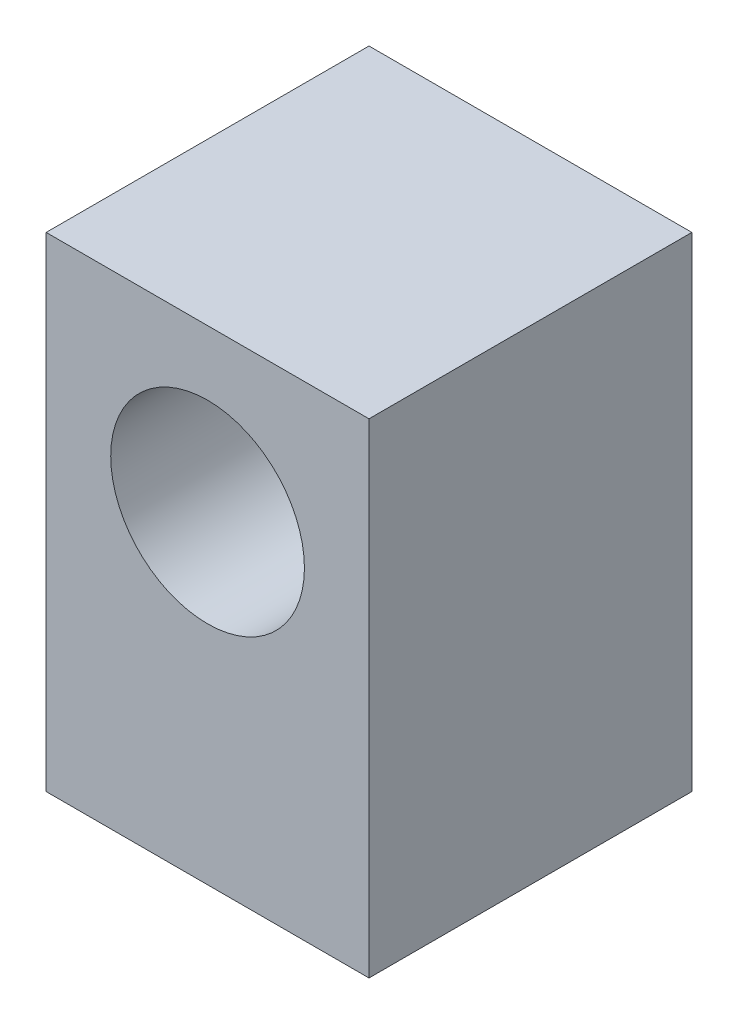
ISO-10303-21;
HEADER;
FILE_DESCRIPTION(('STEP AP214'),'2;1');
FILE_NAME('part.step','',(''),(''),'','','');
FILE_SCHEMA(('AUTOMOTIVE_DESIGN { 1 0 10303 214 1 1 1 1 }'));
ENDSEC;
DATA;
#1=APPLICATION_CONTEXT('core data for automotive mechanical design processes');
#2=APPLICATION_PROTOCOL_DEFINITION('international standard','automotive_design',2000,#1);
#3=PRODUCT_CONTEXT('',#1,'mechanical');
#4=PRODUCT('Part','Part','',(#3));
#5=PRODUCT_RELATED_PRODUCT_CATEGORY('part','',(#4));
#6=PRODUCT_DEFINITION_FORMATION('','',#4);
#7=PRODUCT_DEFINITION_CONTEXT('part definition',#1,'design');
#8=PRODUCT_DEFINITION('design','',#6,#7);
#9=PRODUCT_DEFINITION_SHAPE('','',#8);
#10=(LENGTH_UNIT() NAMED_UNIT(*) SI_UNIT(.MILLI.,.METRE.));
#11=(NAMED_UNIT(*) PLANE_ANGLE_UNIT() SI_UNIT($,.RADIAN.));
#12=(NAMED_UNIT(*) SI_UNIT($,.STERADIAN.) SOLID_ANGLE_UNIT());
#13=UNCERTAINTY_MEASURE_WITH_UNIT(LENGTH_MEASURE(1.E-05),#10,'distance_accuracy_value','');
#14=(GEOMETRIC_REPRESENTATION_CONTEXT(3) GLOBAL_UNCERTAINTY_ASSIGNED_CONTEXT((#13)) GLOBAL_UNIT_ASSIGNED_CONTEXT((#10,
#11,#12)) REPRESENTATION_CONTEXT('',''));
#15=CARTESIAN_POINT('',(0.,0.,0.));
#16=DIRECTION('',(0.,0.,1.));
#17=DIRECTION('',(1.,0.,0.));
#18=AXIS2_PLACEMENT_3D('',#15,#16,#17);
#19=CARTESIAN_POINT('',(10.,30.,-10.));
#20=DIRECTION('',(-1.,0.,0.));
#21=DIRECTION('',(0.,0.,1.));
#22=AXIS2_PLACEMENT_3D('',#19,#20,#21);
#23=PLANE('',#22);
#24=DIRECTION('',(0.,0.,-1.));
#25=VECTOR('',#24,1.);
#26=CARTESIAN_POINT('',(10.,0.,-10.));
#27=LINE('',#26,#25);
#28=CARTESIAN_POINT('',(10.,0.,10.));
#29=VERTEX_POINT('',#28);
#30=CARTESIAN_POINT('',(10.,0.,-10.));
#31=VERTEX_POINT('',#30);
#32=EDGE_CURVE('E108',#29,#31,#27,.T.);
#33=ORIENTED_EDGE('',*,*,#32,.T.);
#34=DIRECTION('',(0.,-1.,0.));
#35=VECTOR('',#34,1.);
#36=CARTESIAN_POINT('',(10.,30.,-10.));
#37=LINE('',#36,#35);
#38=CARTESIAN_POINT('',(10.,30.,-10.));
#39=VERTEX_POINT('',#38);
#40=EDGE_CURVE('E13',#39,#31,#37,.T.);
#41=ORIENTED_EDGE('',*,*,#40,.F.);
#42=DIRECTION('',(0.,0.,-1.));
#43=VECTOR('',#42,1.);
#44=CARTESIAN_POINT('',(10.,30.,-10.));
#45=LINE('',#44,#43);
#46=CARTESIAN_POINT('',(10.,30.,10.));
#47=VERTEX_POINT('',#46);
#48=EDGE_CURVE('E96',#47,#39,#45,.T.);
#49=ORIENTED_EDGE('',*,*,#48,.F.);
#50=DIRECTION('',(0.,-1.,0.));
#51=VECTOR('',#50,1.);
#52=CARTESIAN_POINT('',(10.,30.,10.));
#53=LINE('',#52,#51);
#54=EDGE_CURVE('E104',#47,#29,#53,.T.);
#55=ORIENTED_EDGE('',*,*,#54,.T.);
#56=EDGE_LOOP('',(#33,#41,#49,#55));
#57=FACE_BOUND('',#56,.T.);
#58=ADVANCED_FACE('F45',(#57),#23,.F.);
#59=CARTESIAN_POINT('',(-10.,30.,-10.));
#60=DIRECTION('',(0.,0.,1.));
#61=DIRECTION('',(1.,0.,0.));
#62=AXIS2_PLACEMENT_3D('',#59,#60,#61);
#63=PLANE('',#62);
#64=CARTESIAN_POINT('',(0.,20.,-10.));
#65=DIRECTION('',(0.,0.,1.));
#66=DIRECTION('',(1.,0.,0.));
#67=AXIS2_PLACEMENT_3D('',#64,#65,#66);
#68=CIRCLE('',#67,6.);
#69=CARTESIAN_POINT('',(6.,20.,-10.));
#70=VERTEX_POINT('',#69);
#71=EDGE_CURVE('E111',#70,#70,#68,.F.);
#72=ORIENTED_EDGE('',*,*,#71,.F.);
#73=EDGE_LOOP('',(#72));
#74=FACE_BOUND('',#73,.T.);
#75=DIRECTION('',(-1.,0.,0.));
#76=VECTOR('',#75,1.);
#77=CARTESIAN_POINT('',(-10.,0.,-10.));
#78=LINE('',#77,#76);
#79=CARTESIAN_POINT('',(-10.,0.,-10.));
#80=VERTEX_POINT('',#79);
#81=EDGE_CURVE('E100',#31,#80,#78,.T.);
#82=ORIENTED_EDGE('',*,*,#81,.T.);
#83=DIRECTION('',(0.,-1.,0.));
#84=VECTOR('',#83,1.);
#85=CARTESIAN_POINT('',(-10.,30.,-10.));
#86=LINE('',#85,#84);
#87=CARTESIAN_POINT('',(-10.,30.,-10.));
#88=VERTEX_POINT('',#87);
#89=EDGE_CURVE('E53',#88,#80,#86,.T.);
#90=ORIENTED_EDGE('',*,*,#89,.F.);
#91=DIRECTION('',(-1.,0.,0.));
#92=VECTOR('',#91,1.);
#93=CARTESIAN_POINT('',(-10.,30.,-10.));
#94=LINE('',#93,#92);
#95=EDGE_CURVE('E91',#39,#88,#94,.T.);
#96=ORIENTED_EDGE('',*,*,#95,.F.);
#97=ORIENTED_EDGE('',*,*,#40,.T.);
#98=EDGE_LOOP('',(#82,#90,#96,#97));
#99=FACE_BOUND('',#98,.T.);
#100=ADVANCED_FACE('F99',(#74,#99),#63,.F.);
#101=CARTESIAN_POINT('',(-10.,30.,-10.));
#102=DIRECTION('',(1.,0.,0.));
#103=DIRECTION('',(0.,0.,-1.));
#104=AXIS2_PLACEMENT_3D('',#101,#102,#103);
#105=PLANE('',#104);
#106=DIRECTION('',(0.,0.,1.));
#107=VECTOR('',#106,1.);
#108=CARTESIAN_POINT('',(-10.,0.,-10.));
#109=LINE('',#108,#107);
#110=CARTESIAN_POINT('',(-10.,0.,10.));
#111=VERTEX_POINT('',#110);
#112=EDGE_CURVE('E78',#80,#111,#109,.T.);
#113=ORIENTED_EDGE('',*,*,#112,.T.);
#114=DIRECTION('',(0.,-1.,0.));
#115=VECTOR('',#114,1.);
#116=CARTESIAN_POINT('',(-10.,30.,10.));
#117=LINE('',#116,#115);
#118=CARTESIAN_POINT('',(-10.,30.,10.));
#119=VERTEX_POINT('',#118);
#120=EDGE_CURVE('E101',#119,#111,#117,.T.);
#121=ORIENTED_EDGE('',*,*,#120,.F.);
#122=DIRECTION('',(0.,0.,1.));
#123=VECTOR('',#122,1.);
#124=CARTESIAN_POINT('',(-10.,30.,-10.));
#125=LINE('',#124,#123);
#126=EDGE_CURVE('E94',#88,#119,#125,.T.);
#127=ORIENTED_EDGE('',*,*,#126,.F.);
#128=ORIENTED_EDGE('',*,*,#89,.T.);
#129=EDGE_LOOP('',(#113,#121,#127,#128));
#130=FACE_BOUND('',#129,.T.);
#131=ADVANCED_FACE('F102',(#130),#105,.F.);
#132=CARTESIAN_POINT('',(-10.,30.,10.));
#133=DIRECTION('',(0.,0.,-1.));
#134=DIRECTION('',(-1.,0.,0.));
#135=AXIS2_PLACEMENT_3D('',#132,#133,#134);
#136=PLANE('',#135);
#137=CARTESIAN_POINT('',(0.,20.,10.));
#138=DIRECTION('',(0.,0.,1.));
#139=DIRECTION('',(1.,0.,0.));
#140=AXIS2_PLACEMENT_3D('',#137,#138,#139);
#141=CIRCLE('',#140,6.);
#142=CARTESIAN_POINT('',(6.,20.,10.));
#143=VERTEX_POINT('',#142);
#144=EDGE_CURVE('E124',#143,#143,#141,.T.);
#145=ORIENTED_EDGE('',*,*,#144,.F.);
#146=EDGE_LOOP('',(#145));
#147=FACE_BOUND('',#146,.T.);
#148=DIRECTION('',(1.,0.,0.));
#149=VECTOR('',#148,1.);
#150=CARTESIAN_POINT('',(-10.,0.,10.));
#151=LINE('',#150,#149);
#152=EDGE_CURVE('E84',#111,#29,#151,.T.);
#153=ORIENTED_EDGE('',*,*,#152,.T.);
#154=ORIENTED_EDGE('',*,*,#54,.F.);
#155=DIRECTION('',(1.,0.,0.));
#156=VECTOR('',#155,1.);
#157=CARTESIAN_POINT('',(-10.,30.,10.));
#158=LINE('',#157,#156);
#159=EDGE_CURVE('E61',#119,#47,#158,.T.);
#160=ORIENTED_EDGE('',*,*,#159,.F.);
#161=ORIENTED_EDGE('',*,*,#120,.T.);
#162=EDGE_LOOP('',(#153,#154,#160,#161));
#163=FACE_BOUND('',#162,.T.);
#164=ADVANCED_FACE('F116',(#147,#163),#136,.F.);
#165=CARTESIAN_POINT('',(0.,30.,0.));
#166=DIRECTION('',(0.,1.,0.));
#167=DIRECTION('',(0.,0.,1.));
#168=AXIS2_PLACEMENT_3D('',#165,#166,#167);
#169=PLANE('',#168);
#170=ORIENTED_EDGE('',*,*,#48,.T.);
#171=ORIENTED_EDGE('',*,*,#95,.T.);
#172=ORIENTED_EDGE('',*,*,#126,.T.);
#173=ORIENTED_EDGE('',*,*,#159,.T.);
#174=EDGE_LOOP('',(#170,#171,#172,#173));
#175=FACE_BOUND('',#174,.T.);
#176=ADVANCED_FACE('F92',(#175),#169,.T.);
#177=CARTESIAN_POINT('',(0.,0.,0.));
#178=DIRECTION('',(0.,1.,0.));
#179=DIRECTION('',(0.,0.,1.));
#180=AXIS2_PLACEMENT_3D('',#177,#178,#179);
#181=PLANE('',#180);
#182=ORIENTED_EDGE('',*,*,#32,.F.);
#183=ORIENTED_EDGE('',*,*,#152,.F.);
#184=ORIENTED_EDGE('',*,*,#112,.F.);
#185=ORIENTED_EDGE('',*,*,#81,.F.);
#186=EDGE_LOOP('',(#182,#183,#184,#185));
#187=FACE_BOUND('',#186,.T.);
#188=ADVANCED_FACE('F119',(#187),#181,.F.);
#189=CARTESIAN_POINT('',(0.,20.,-10.001));
#190=DIRECTION('',(0.,0.,1.));
#191=DIRECTION('',(1.,0.,0.));
#192=AXIS2_PLACEMENT_3D('',#189,#190,#191);
#193=CYLINDRICAL_SURFACE('',#192,6.);
#194=ORIENTED_EDGE('',*,*,#144,.T.);
#195=EDGE_LOOP('',(#194));
#196=FACE_BOUND('',#195,.T.);
#197=ORIENTED_EDGE('',*,*,#71,.T.);
#198=EDGE_LOOP('',(#197));
#199=FACE_BOUND('',#198,.T.);
#200=ADVANCED_FACE('F128',(#196,#199),#193,.F.);
#201=CLOSED_SHELL('',(#58,#100,#131,#164,#176,#188,#200));
#202=MANIFOLD_SOLID_BREP('B2',#201);
#203=ADVANCED_BREP_SHAPE_REPRESENTATION('',(#18,#202),#14);
#204=SHAPE_DEFINITION_REPRESENTATION(#9,#203);
ENDSEC;
END-ISO-10303-21;
